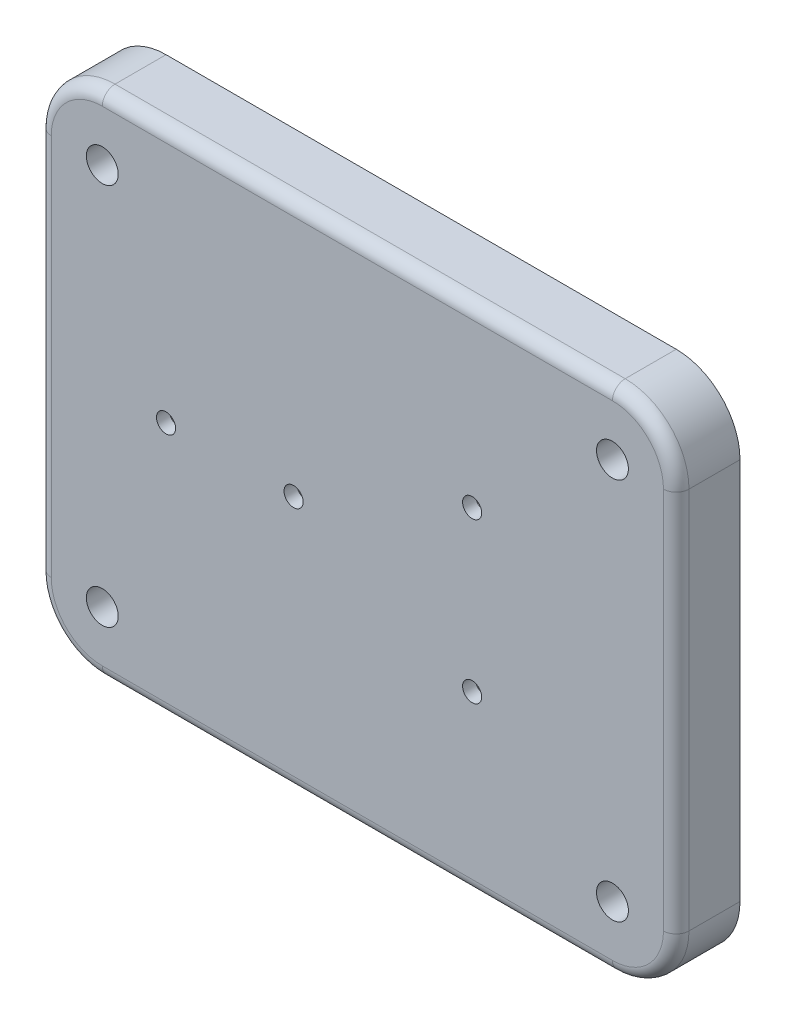
ISO-10303-21;
HEADER;
FILE_DESCRIPTION(('STEP AP214'),'2;1');
FILE_NAME('part.step','',(''),(''),'','','');
FILE_SCHEMA(('AUTOMOTIVE_DESIGN { 1 0 10303 214 1 1 1 1 }'));
ENDSEC;
DATA;
#1=APPLICATION_CONTEXT('core data for automotive mechanical design processes');
#2=APPLICATION_PROTOCOL_DEFINITION('international standard','automotive_design',2000,#1);
#3=PRODUCT_CONTEXT('',#1,'mechanical');
#4=PRODUCT('Part','Part','',(#3));
#5=PRODUCT_RELATED_PRODUCT_CATEGORY('part','',(#4));
#6=PRODUCT_DEFINITION_FORMATION('','',#4);
#7=PRODUCT_DEFINITION_CONTEXT('part definition',#1,'design');
#8=PRODUCT_DEFINITION('design','',#6,#7);
#9=PRODUCT_DEFINITION_SHAPE('','',#8);
#10=(LENGTH_UNIT() NAMED_UNIT(*) SI_UNIT(.MILLI.,.METRE.));
#11=(NAMED_UNIT(*) PLANE_ANGLE_UNIT() SI_UNIT($,.RADIAN.));
#12=(NAMED_UNIT(*) SI_UNIT($,.STERADIAN.) SOLID_ANGLE_UNIT());
#13=UNCERTAINTY_MEASURE_WITH_UNIT(LENGTH_MEASURE(1.E-05),#10,'distance_accuracy_value','');
#14=(GEOMETRIC_REPRESENTATION_CONTEXT(3) GLOBAL_UNCERTAINTY_ASSIGNED_CONTEXT((#13)) GLOBAL_UNIT_ASSIGNED_CONTEXT((#10,
#11,#12)) REPRESENTATION_CONTEXT('',''));
#15=CARTESIAN_POINT('',(0.,0.,0.));
#16=DIRECTION('',(0.,0.,1.));
#17=DIRECTION('',(1.,0.,0.));
#18=AXIS2_PLACEMENT_3D('',#15,#16,#17);
#19=CARTESIAN_POINT('',(0.,0.,0.));
#20=DIRECTION('',(0.,0.,1.));
#21=DIRECTION('',(1.,0.,0.));
#22=AXIS2_PLACEMENT_3D('',#19,#20,#21);
#23=PLANE('',#22);
#24=CARTESIAN_POINT('',(40.,30.,0.));
#25=DIRECTION('',(0.,0.,1.));
#26=DIRECTION('',(1.,0.,0.));
#27=AXIS2_PLACEMENT_3D('',#24,#25,#26);
#28=CIRCLE('',#27,4.5);
#29=CARTESIAN_POINT('',(44.5,30.,0.));
#30=VERTEX_POINT('',#29);
#31=EDGE_CURVE('E235',#30,#30,#28,.T.);
#32=ORIENTED_EDGE('',*,*,#31,.F.);
#33=EDGE_LOOP('',(#32));
#34=FACE_BOUND('',#33,.T.);
#35=CARTESIAN_POINT('',(40.,30.,0.));
#36=DIRECTION('',(0.,0.,1.));
#37=DIRECTION('',(1.,0.,0.));
#38=AXIS2_PLACEMENT_3D('',#35,#36,#37);
#39=CIRCLE('',#38,2.5);
#40=CARTESIAN_POINT('',(42.5,30.,0.));
#41=VERTEX_POINT('',#40);
#42=EDGE_CURVE('E322',#41,#41,#39,.T.);
#43=ORIENTED_EDGE('',*,*,#42,.T.);
#44=EDGE_LOOP('',(#43));
#45=FACE_BOUND('',#44,.T.);
#46=ADVANCED_FACE('F39',(#34,#45),#23,.F.);
#47=CARTESIAN_POINT('',(40.,-30.,0.));
#48=DIRECTION('',(0.,0.,1.));
#49=DIRECTION('',(1.,0.,0.));
#50=AXIS2_PLACEMENT_3D('',#47,#48,#49);
#51=CIRCLE('',#50,4.5);
#52=CARTESIAN_POINT('',(44.5,-30.,0.));
#53=VERTEX_POINT('',#52);
#54=EDGE_CURVE('E240',#53,#53,#51,.T.);
#55=ORIENTED_EDGE('',*,*,#54,.F.);
#56=EDGE_LOOP('',(#55));
#57=FACE_BOUND('',#56,.T.);
#58=CARTESIAN_POINT('',(40.,-30.,0.));
#59=DIRECTION('',(0.,0.,1.));
#60=DIRECTION('',(1.,0.,0.));
#61=AXIS2_PLACEMENT_3D('',#58,#59,#60);
#62=CIRCLE('',#61,2.5);
#63=CARTESIAN_POINT('',(42.5,-30.,0.));
#64=VERTEX_POINT('',#63);
#65=EDGE_CURVE('E314',#64,#64,#62,.T.);
#66=ORIENTED_EDGE('',*,*,#65,.T.);
#67=EDGE_LOOP('',(#66));
#68=FACE_BOUND('',#67,.T.);
#69=ADVANCED_FACE('F498',(#57,#68),#23,.F.);
#70=CARTESIAN_POINT('',(-40.,-30.,0.));
#71=DIRECTION('',(0.,0.,1.));
#72=DIRECTION('',(1.,0.,0.));
#73=AXIS2_PLACEMENT_3D('',#70,#71,#72);
#74=CIRCLE('',#73,4.5);
#75=CARTESIAN_POINT('',(-35.5,-30.,0.));
#76=VERTEX_POINT('',#75);
#77=EDGE_CURVE('E245',#76,#76,#74,.T.);
#78=ORIENTED_EDGE('',*,*,#77,.F.);
#79=EDGE_LOOP('',(#78));
#80=FACE_BOUND('',#79,.T.);
#81=CARTESIAN_POINT('',(-40.,-30.,0.));
#82=DIRECTION('',(0.,0.,1.));
#83=DIRECTION('',(1.,0.,0.));
#84=AXIS2_PLACEMENT_3D('',#81,#82,#83);
#85=CIRCLE('',#84,2.5);
#86=CARTESIAN_POINT('',(-37.5,-30.,0.));
#87=VERTEX_POINT('',#86);
#88=EDGE_CURVE('E305',#87,#87,#85,.T.);
#89=ORIENTED_EDGE('',*,*,#88,.T.);
#90=EDGE_LOOP('',(#89));
#91=FACE_BOUND('',#90,.T.);
#92=ADVANCED_FACE('F505',(#80,#91),#23,.F.);
#93=DIRECTION('',(1.,0.,0.));
#94=VECTOR('',#93,1.);
#95=CARTESIAN_POINT('',(-50.,-40.,0.));
#96=LINE('',#95,#94);
#97=CARTESIAN_POINT('',(-40.,-40.,0.));
#98=VERTEX_POINT('',#97);
#99=CARTESIAN_POINT('',(40.,-40.,0.));
#100=VERTEX_POINT('',#99);
#101=EDGE_CURVE('E350',#98,#100,#96,.T.);
#102=ORIENTED_EDGE('',*,*,#101,.F.);
#103=CARTESIAN_POINT('',(-40.,-30.,0.));
#104=DIRECTION('',(0.,0.,1.));
#105=DIRECTION('',(1.,0.,0.));
#106=AXIS2_PLACEMENT_3D('',#103,#104,#105);
#107=CIRCLE('',#106,10.);
#108=CARTESIAN_POINT('',(-50.,-30.,0.));
#109=VERTEX_POINT('',#108);
#110=EDGE_CURVE('E370',#98,#109,#107,.F.);
#111=ORIENTED_EDGE('',*,*,#110,.T.);
#112=DIRECTION('',(0.,-1.,0.));
#113=VECTOR('',#112,1.);
#114=CARTESIAN_POINT('',(-50.,40.,0.));
#115=LINE('',#114,#113);
#116=CARTESIAN_POINT('',(-50.,30.,0.));
#117=VERTEX_POINT('',#116);
#118=EDGE_CURVE('E346',#117,#109,#115,.T.);
#119=ORIENTED_EDGE('',*,*,#118,.F.);
#120=CARTESIAN_POINT('',(-40.,30.,0.));
#121=DIRECTION('',(0.,0.,1.));
#122=DIRECTION('',(1.,0.,0.));
#123=AXIS2_PLACEMENT_3D('',#120,#121,#122);
#124=CIRCLE('',#123,10.);
#125=CARTESIAN_POINT('',(-40.,40.,0.));
#126=VERTEX_POINT('',#125);
#127=EDGE_CURVE('E361',#117,#126,#124,.F.);
#128=ORIENTED_EDGE('',*,*,#127,.T.);
#129=DIRECTION('',(-1.,0.,0.));
#130=VECTOR('',#129,1.);
#131=CARTESIAN_POINT('',(-50.,40.,0.));
#132=LINE('',#131,#130);
#133=CARTESIAN_POINT('',(40.,40.,0.));
#134=VERTEX_POINT('',#133);
#135=EDGE_CURVE('E342',#134,#126,#132,.T.);
#136=ORIENTED_EDGE('',*,*,#135,.F.);
#137=CARTESIAN_POINT('',(40.,30.,0.));
#138=DIRECTION('',(0.,0.,1.));
#139=DIRECTION('',(1.,0.,0.));
#140=AXIS2_PLACEMENT_3D('',#137,#138,#139);
#141=CIRCLE('',#140,10.);
#142=CARTESIAN_POINT('',(50.,30.,0.));
#143=VERTEX_POINT('',#142);
#144=EDGE_CURVE('E364',#134,#143,#141,.F.);
#145=ORIENTED_EDGE('',*,*,#144,.T.);
#146=DIRECTION('',(0.,1.,0.));
#147=VECTOR('',#146,1.);
#148=CARTESIAN_POINT('',(50.,40.,0.));
#149=LINE('',#148,#147);
#150=CARTESIAN_POINT('',(50.,-30.,0.));
#151=VERTEX_POINT('',#150);
#152=EDGE_CURVE('E335',#151,#143,#149,.T.);
#153=ORIENTED_EDGE('',*,*,#152,.F.);
#154=CARTESIAN_POINT('',(40.,-30.,0.));
#155=DIRECTION('',(0.,0.,1.));
#156=DIRECTION('',(1.,0.,0.));
#157=AXIS2_PLACEMENT_3D('',#154,#155,#156);
#158=CIRCLE('',#157,10.);
#159=EDGE_CURVE('E367',#151,#100,#158,.F.);
#160=ORIENTED_EDGE('',*,*,#159,.T.);
#161=EDGE_LOOP('',(#102,#111,#119,#128,#136,#145,#153,#160));
#162=FACE_BOUND('',#161,.T.);
#163=CARTESIAN_POINT('',(-40.,-30.,0.));
#164=DIRECTION('',(0.,0.,1.));
#165=DIRECTION('',(1.,0.,0.));
#166=AXIS2_PLACEMENT_3D('',#163,#164,#165);
#167=CIRCLE('',#166,8.);
#168=CARTESIAN_POINT('',(-40.,-38.,0.));
#169=VERTEX_POINT('',#168);
#170=CARTESIAN_POINT('',(-48.,-30.,0.));
#171=VERTEX_POINT('',#170);
#172=EDGE_CURVE('E259',#169,#171,#167,.F.);
#173=ORIENTED_EDGE('',*,*,#172,.F.);
#174=DIRECTION('',(1.,0.,0.));
#175=VECTOR('',#174,1.);
#176=CARTESIAN_POINT('',(-50.,-38.,0.));
#177=LINE('',#176,#175);
#178=CARTESIAN_POINT('',(40.,-38.,0.));
#179=VERTEX_POINT('',#178);
#180=EDGE_CURVE('E270',#169,#179,#177,.T.);
#181=ORIENTED_EDGE('',*,*,#180,.T.);
#182=CARTESIAN_POINT('',(40.,-30.,0.));
#183=DIRECTION('',(0.,0.,1.));
#184=DIRECTION('',(1.,0.,0.));
#185=AXIS2_PLACEMENT_3D('',#182,#183,#184);
#186=CIRCLE('',#185,8.);
#187=CARTESIAN_POINT('',(48.,-30.,0.));
#188=VERTEX_POINT('',#187);
#189=EDGE_CURVE('E274',#188,#179,#186,.F.);
#190=ORIENTED_EDGE('',*,*,#189,.F.);
#191=DIRECTION('',(0.,1.,0.));
#192=VECTOR('',#191,1.);
#193=CARTESIAN_POINT('',(48.,40.,0.));
#194=LINE('',#193,#192);
#195=CARTESIAN_POINT('',(48.,30.,0.));
#196=VERTEX_POINT('',#195);
#197=EDGE_CURVE('E57',#188,#196,#194,.T.);
#198=ORIENTED_EDGE('',*,*,#197,.T.);
#199=CARTESIAN_POINT('',(40.,30.,0.));
#200=DIRECTION('',(0.,0.,1.));
#201=DIRECTION('',(1.,0.,0.));
#202=AXIS2_PLACEMENT_3D('',#199,#200,#201);
#203=CIRCLE('',#202,8.);
#204=CARTESIAN_POINT('',(40.,38.,0.));
#205=VERTEX_POINT('',#204);
#206=EDGE_CURVE('E184',#205,#196,#203,.F.);
#207=ORIENTED_EDGE('',*,*,#206,.F.);
#208=DIRECTION('',(-1.,0.,0.));
#209=VECTOR('',#208,1.);
#210=CARTESIAN_POINT('',(-50.,38.,0.));
#211=LINE('',#210,#209);
#212=CARTESIAN_POINT('',(-40.,38.,0.));
#213=VERTEX_POINT('',#212);
#214=EDGE_CURVE('E273',#205,#213,#211,.T.);
#215=ORIENTED_EDGE('',*,*,#214,.T.);
#216=CARTESIAN_POINT('',(-40.,30.,0.));
#217=DIRECTION('',(0.,0.,1.));
#218=DIRECTION('',(1.,0.,0.));
#219=AXIS2_PLACEMENT_3D('',#216,#217,#218);
#220=CIRCLE('',#219,8.);
#221=CARTESIAN_POINT('',(-48.,30.,0.));
#222=VERTEX_POINT('',#221);
#223=EDGE_CURVE('E266',#222,#213,#220,.F.);
#224=ORIENTED_EDGE('',*,*,#223,.F.);
#225=DIRECTION('',(0.,-1.,0.));
#226=VECTOR('',#225,1.);
#227=CARTESIAN_POINT('',(-48.,40.,0.));
#228=LINE('',#227,#226);
#229=EDGE_CURVE('E280',#222,#171,#228,.T.);
#230=ORIENTED_EDGE('',*,*,#229,.T.);
#231=EDGE_LOOP('',(#173,#181,#190,#198,#207,#215,#224,#230));
#232=FACE_BOUND('',#231,.T.);
#233=ADVANCED_FACE('F515',(#162,#232),#23,.F.);
#234=CARTESIAN_POINT('',(50.,40.,10.));
#235=DIRECTION('',(-1.,0.,0.));
#236=DIRECTION('',(0.,-1.,0.));
#237=AXIS2_PLACEMENT_3D('',#234,#235,#236);
#238=PLANE('',#237);
#239=DIRECTION('',(0.,0.,-1.));
#240=VECTOR('',#239,1.);
#241=CARTESIAN_POINT('',(50.,30.,10.));
#242=LINE('',#241,#240);
#243=CARTESIAN_POINT('',(50.,30.,8.));
#244=VERTEX_POINT('',#243);
#245=EDGE_CURVE('E380',#143,#244,#242,.F.);
#246=ORIENTED_EDGE('',*,*,#245,.T.);
#247=DIRECTION('',(0.,1.,0.));
#248=VECTOR('',#247,1.);
#249=CARTESIAN_POINT('',(50.,-30.,8.));
#250=LINE('',#249,#248);
#251=CARTESIAN_POINT('',(50.,-30.,8.));
#252=VERTEX_POINT('',#251);
#253=EDGE_CURVE('E422',#244,#252,#250,.F.);
#254=ORIENTED_EDGE('',*,*,#253,.T.);
#255=DIRECTION('',(0.,0.,-1.));
#256=VECTOR('',#255,1.);
#257=CARTESIAN_POINT('',(50.,-30.,10.));
#258=LINE('',#257,#256);
#259=EDGE_CURVE('E384',#252,#151,#258,.T.);
#260=ORIENTED_EDGE('',*,*,#259,.T.);
#261=ORIENTED_EDGE('',*,*,#152,.T.);
#262=EDGE_LOOP('',(#246,#254,#260,#261));
#263=FACE_BOUND('',#262,.T.);
#264=ADVANCED_FACE('F528',(#263),#238,.F.);
#265=CARTESIAN_POINT('',(-50.,40.,10.));
#266=DIRECTION('',(0.,-1.,0.));
#267=DIRECTION('',(0.,0.,-1.));
#268=AXIS2_PLACEMENT_3D('',#265,#266,#267);
#269=PLANE('',#268);
#270=DIRECTION('',(0.,0.,-1.));
#271=VECTOR('',#270,1.);
#272=CARTESIAN_POINT('',(-40.,40.,10.));
#273=LINE('',#272,#271);
#274=CARTESIAN_POINT('',(-40.,40.,8.));
#275=VERTEX_POINT('',#274);
#276=EDGE_CURVE('E387',#126,#275,#273,.F.);
#277=ORIENTED_EDGE('',*,*,#276,.T.);
#278=DIRECTION('',(-1.,0.,0.));
#279=VECTOR('',#278,1.);
#280=CARTESIAN_POINT('',(40.,40.,8.));
#281=LINE('',#280,#279);
#282=CARTESIAN_POINT('',(40.,40.,8.));
#283=VERTEX_POINT('',#282);
#284=EDGE_CURVE('E11',#275,#283,#281,.F.);
#285=ORIENTED_EDGE('',*,*,#284,.T.);
#286=DIRECTION('',(0.,0.,-1.));
#287=VECTOR('',#286,1.);
#288=CARTESIAN_POINT('',(40.,40.,10.));
#289=LINE('',#288,#287);
#290=EDGE_CURVE('E390',#283,#134,#289,.T.);
#291=ORIENTED_EDGE('',*,*,#290,.T.);
#292=ORIENTED_EDGE('',*,*,#135,.T.);
#293=EDGE_LOOP('',(#277,#285,#291,#292));
#294=FACE_BOUND('',#293,.T.);
#295=ADVANCED_FACE('F534',(#294),#269,.F.);
#296=CARTESIAN_POINT('',(-50.,40.,10.));
#297=DIRECTION('',(1.,0.,0.));
#298=DIRECTION('',(0.,0.,-1.));
#299=AXIS2_PLACEMENT_3D('',#296,#297,#298);
#300=PLANE('',#299);
#301=DIRECTION('',(0.,0.,-1.));
#302=VECTOR('',#301,1.);
#303=CARTESIAN_POINT('',(-50.,-30.,10.));
#304=LINE('',#303,#302);
#305=CARTESIAN_POINT('',(-50.,-30.,8.));
#306=VERTEX_POINT('',#305);
#307=EDGE_CURVE('E376',#109,#306,#304,.F.);
#308=ORIENTED_EDGE('',*,*,#307,.T.);
#309=DIRECTION('',(0.,-1.,0.));
#310=VECTOR('',#309,1.);
#311=CARTESIAN_POINT('',(-50.,30.,8.));
#312=LINE('',#311,#310);
#313=CARTESIAN_POINT('',(-50.,30.,8.));
#314=VERTEX_POINT('',#313);
#315=EDGE_CURVE('E434',#306,#314,#312,.F.);
#316=ORIENTED_EDGE('',*,*,#315,.T.);
#317=DIRECTION('',(0.,0.,-1.));
#318=VECTOR('',#317,1.);
#319=CARTESIAN_POINT('',(-50.,30.,10.));
#320=LINE('',#319,#318);
#321=EDGE_CURVE('E373',#314,#117,#320,.T.);
#322=ORIENTED_EDGE('',*,*,#321,.T.);
#323=ORIENTED_EDGE('',*,*,#118,.T.);
#324=EDGE_LOOP('',(#308,#316,#322,#323));
#325=FACE_BOUND('',#324,.T.);
#326=ADVANCED_FACE('F664',(#325),#300,.F.);
#327=CARTESIAN_POINT('',(-50.,-40.,10.));
#328=DIRECTION('',(0.,1.,0.));
#329=DIRECTION('',(0.,0.,1.));
#330=AXIS2_PLACEMENT_3D('',#327,#328,#329);
#331=PLANE('',#330);
#332=DIRECTION('',(0.,0.,-1.));
#333=VECTOR('',#332,1.);
#334=CARTESIAN_POINT('',(40.,-40.,10.));
#335=LINE('',#334,#333);
#336=CARTESIAN_POINT('',(40.,-40.,8.));
#337=VERTEX_POINT('',#336);
#338=EDGE_CURVE('E354',#100,#337,#335,.F.);
#339=ORIENTED_EDGE('',*,*,#338,.T.);
#340=DIRECTION('',(1.,0.,0.));
#341=VECTOR('',#340,1.);
#342=CARTESIAN_POINT('',(-40.,-40.,8.));
#343=LINE('',#342,#341);
#344=CARTESIAN_POINT('',(-40.,-40.,8.));
#345=VERTEX_POINT('',#344);
#346=EDGE_CURVE('E428',#337,#345,#343,.F.);
#347=ORIENTED_EDGE('',*,*,#346,.T.);
#348=DIRECTION('',(0.,0.,-1.));
#349=VECTOR('',#348,1.);
#350=CARTESIAN_POINT('',(-40.,-40.,10.));
#351=LINE('',#350,#349);
#352=EDGE_CURVE('E358',#345,#98,#351,.T.);
#353=ORIENTED_EDGE('',*,*,#352,.T.);
#354=ORIENTED_EDGE('',*,*,#101,.T.);
#355=EDGE_LOOP('',(#339,#347,#353,#354));
#356=FACE_BOUND('',#355,.T.);
#357=ADVANCED_FACE('F523',(#356),#331,.F.);
#358=CARTESIAN_POINT('',(0.,0.,10.));
#359=DIRECTION('',(0.,0.,1.));
#360=DIRECTION('',(1.,0.,0.));
#361=AXIS2_PLACEMENT_3D('',#358,#359,#360);
#362=PLANE('',#361);
#363=CARTESIAN_POINT('',(-30.,0.,10.));
#364=DIRECTION('',(0.,0.,1.));
#365=DIRECTION('',(1.,0.,0.));
#366=AXIS2_PLACEMENT_3D('',#363,#364,#365);
#367=CIRCLE('',#366,1.5);
#368=CARTESIAN_POINT('',(-28.5,0.,10.));
#369=VERTEX_POINT('',#368);
#370=EDGE_CURVE('E472',#369,#369,#367,.T.);
#371=ORIENTED_EDGE('',*,*,#370,.F.);
#372=EDGE_LOOP('',(#371));
#373=FACE_BOUND('',#372,.T.);
#374=CARTESIAN_POINT('',(-10.,0.,10.));
#375=DIRECTION('',(0.,0.,1.));
#376=DIRECTION('',(1.,0.,0.));
#377=AXIS2_PLACEMENT_3D('',#374,#375,#376);
#378=CIRCLE('',#377,1.5);
#379=CARTESIAN_POINT('',(-8.5,0.,10.));
#380=VERTEX_POINT('',#379);
#381=EDGE_CURVE('E915',#380,#380,#378,.T.);
#382=ORIENTED_EDGE('',*,*,#381,.F.);
#383=EDGE_LOOP('',(#382));
#384=FACE_BOUND('',#383,.T.);
#385=CARTESIAN_POINT('',(18.,12.5,10.));
#386=DIRECTION('',(0.,0.,1.));
#387=DIRECTION('',(1.,0.,0.));
#388=AXIS2_PLACEMENT_3D('',#385,#386,#387);
#389=CIRCLE('',#388,1.5);
#390=CARTESIAN_POINT('',(19.5,12.5,10.));
#391=VERTEX_POINT('',#390);
#392=EDGE_CURVE('E907',#391,#391,#389,.T.);
#393=ORIENTED_EDGE('',*,*,#392,.F.);
#394=EDGE_LOOP('',(#393));
#395=FACE_BOUND('',#394,.T.);
#396=CARTESIAN_POINT('',(18.,-12.5,10.));
#397=DIRECTION('',(0.,0.,1.));
#398=DIRECTION('',(1.,0.,0.));
#399=AXIS2_PLACEMENT_3D('',#396,#397,#398);
#400=CIRCLE('',#399,1.5);
#401=CARTESIAN_POINT('',(19.5,-12.5,10.));
#402=VERTEX_POINT('',#401);
#403=EDGE_CURVE('E916',#402,#402,#400,.T.);
#404=ORIENTED_EDGE('',*,*,#403,.F.);
#405=EDGE_LOOP('',(#404));
#406=FACE_BOUND('',#405,.T.);
#407=DIRECTION('',(0.,1.,0.));
#408=VECTOR('',#407,1.);
#409=CARTESIAN_POINT('',(48.,30.,10.));
#410=LINE('',#409,#408);
#411=CARTESIAN_POINT('',(48.,-30.,10.));
#412=VERTEX_POINT('',#411);
#413=CARTESIAN_POINT('',(48.,30.,10.));
#414=VERTEX_POINT('',#413);
#415=EDGE_CURVE('E411',#412,#414,#410,.T.);
#416=ORIENTED_EDGE('',*,*,#415,.T.);
#417=CARTESIAN_POINT('',(40.,30.,10.));
#418=DIRECTION('',(0.,0.,1.));
#419=DIRECTION('',(1.,0.,0.));
#420=AXIS2_PLACEMENT_3D('',#417,#418,#419);
#421=CIRCLE('',#420,8.);
#422=CARTESIAN_POINT('',(40.,38.,10.));
#423=VERTEX_POINT('',#422);
#424=EDGE_CURVE('E414',#414,#423,#421,.T.);
#425=ORIENTED_EDGE('',*,*,#424,.T.);
#426=DIRECTION('',(-1.,0.,0.));
#427=VECTOR('',#426,1.);
#428=CARTESIAN_POINT('',(-40.,38.,10.));
#429=LINE('',#428,#427);
#430=CARTESIAN_POINT('',(-40.,38.,10.));
#431=VERTEX_POINT('',#430);
#432=EDGE_CURVE('E393',#423,#431,#429,.T.);
#433=ORIENTED_EDGE('',*,*,#432,.T.);
#434=CARTESIAN_POINT('',(-40.,30.,10.));
#435=DIRECTION('',(0.,0.,1.));
#436=DIRECTION('',(1.,0.,0.));
#437=AXIS2_PLACEMENT_3D('',#434,#435,#436);
#438=CIRCLE('',#437,8.);
#439=CARTESIAN_POINT('',(-48.,30.,10.));
#440=VERTEX_POINT('',#439);
#441=EDGE_CURVE('E396',#431,#440,#438,.T.);
#442=ORIENTED_EDGE('',*,*,#441,.T.);
#443=DIRECTION('',(0.,-1.,0.));
#444=VECTOR('',#443,1.);
#445=CARTESIAN_POINT('',(-48.,-30.,10.));
#446=LINE('',#445,#444);
#447=CARTESIAN_POINT('',(-48.,-30.,10.));
#448=VERTEX_POINT('',#447);
#449=EDGE_CURVE('E399',#440,#448,#446,.T.);
#450=ORIENTED_EDGE('',*,*,#449,.T.);
#451=CARTESIAN_POINT('',(-40.,-30.,10.));
#452=DIRECTION('',(0.,0.,1.));
#453=DIRECTION('',(1.,0.,0.));
#454=AXIS2_PLACEMENT_3D('',#451,#452,#453);
#455=CIRCLE('',#454,8.);
#456=CARTESIAN_POINT('',(-40.,-38.,10.));
#457=VERTEX_POINT('',#456);
#458=EDGE_CURVE('E402',#448,#457,#455,.T.);
#459=ORIENTED_EDGE('',*,*,#458,.T.);
#460=DIRECTION('',(1.,0.,0.));
#461=VECTOR('',#460,1.);
#462=CARTESIAN_POINT('',(40.,-38.,10.));
#463=LINE('',#462,#461);
#464=CARTESIAN_POINT('',(40.,-38.,10.));
#465=VERTEX_POINT('',#464);
#466=EDGE_CURVE('E405',#457,#465,#463,.T.);
#467=ORIENTED_EDGE('',*,*,#466,.T.);
#468=CARTESIAN_POINT('',(40.,-30.,10.));
#469=DIRECTION('',(0.,0.,1.));
#470=DIRECTION('',(1.,0.,0.));
#471=AXIS2_PLACEMENT_3D('',#468,#469,#470);
#472=CIRCLE('',#471,8.);
#473=EDGE_CURVE('E408',#465,#412,#472,.T.);
#474=ORIENTED_EDGE('',*,*,#473,.T.);
#475=EDGE_LOOP('',(#416,#425,#433,#442,#450,#459,#467,#474));
#476=FACE_BOUND('',#475,.T.);
#477=CARTESIAN_POINT('',(40.,30.,10.));
#478=DIRECTION('',(0.,0.,1.));
#479=DIRECTION('',(1.,0.,0.));
#480=AXIS2_PLACEMENT_3D('',#477,#478,#479);
#481=CIRCLE('',#480,2.5);
#482=CARTESIAN_POINT('',(42.5,30.,10.));
#483=VERTEX_POINT('',#482);
#484=EDGE_CURVE('E326',#483,#483,#481,.T.);
#485=ORIENTED_EDGE('',*,*,#484,.F.);
#486=EDGE_LOOP('',(#485));
#487=FACE_BOUND('',#486,.T.);
#488=CARTESIAN_POINT('',(40.,-30.,10.));
#489=DIRECTION('',(0.,0.,1.));
#490=DIRECTION('',(1.,0.,0.));
#491=AXIS2_PLACEMENT_3D('',#488,#489,#490);
#492=CIRCLE('',#491,2.5);
#493=CARTESIAN_POINT('',(42.5,-30.,10.));
#494=VERTEX_POINT('',#493);
#495=EDGE_CURVE('E318',#494,#494,#492,.T.);
#496=ORIENTED_EDGE('',*,*,#495,.F.);
#497=EDGE_LOOP('',(#496));
#498=FACE_BOUND('',#497,.T.);
#499=CARTESIAN_POINT('',(-40.,-30.,10.));
#500=DIRECTION('',(0.,0.,1.));
#501=DIRECTION('',(1.,0.,0.));
#502=AXIS2_PLACEMENT_3D('',#499,#500,#501);
#503=CIRCLE('',#502,2.5);
#504=CARTESIAN_POINT('',(-37.5,-30.,10.));
#505=VERTEX_POINT('',#504);
#506=EDGE_CURVE('E310',#505,#505,#503,.T.);
#507=ORIENTED_EDGE('',*,*,#506,.F.);
#508=EDGE_LOOP('',(#507));
#509=FACE_BOUND('',#508,.T.);
#510=CARTESIAN_POINT('',(-40.,30.,10.));
#511=DIRECTION('',(0.,0.,1.));
#512=DIRECTION('',(1.,0.,0.));
#513=AXIS2_PLACEMENT_3D('',#510,#511,#512);
#514=CIRCLE('',#513,2.5);
#515=CARTESIAN_POINT('',(-37.5,30.,10.));
#516=VERTEX_POINT('',#515);
#517=EDGE_CURVE('E309',#516,#516,#514,.T.);
#518=ORIENTED_EDGE('',*,*,#517,.F.);
#519=EDGE_LOOP('',(#518));
#520=FACE_BOUND('',#519,.T.);
#521=ADVANCED_FACE('F513',(#373,#384,#395,#406,#476,#487,#498,#509,#520),#362,.T.);
#522=CARTESIAN_POINT('',(-40.,30.,0.));
#523=DIRECTION('',(0.,0.,1.));
#524=DIRECTION('',(1.,0.,0.));
#525=AXIS2_PLACEMENT_3D('',#522,#523,#524);
#526=CIRCLE('',#525,4.5);
#527=CARTESIAN_POINT('',(-35.5,30.,0.));
#528=VERTEX_POINT('',#527);
#529=EDGE_CURVE('E250',#528,#528,#526,.T.);
#530=ORIENTED_EDGE('',*,*,#529,.F.);
#531=EDGE_LOOP('',(#530));
#532=FACE_BOUND('',#531,.T.);
#533=CARTESIAN_POINT('',(-40.,30.,0.));
#534=DIRECTION('',(0.,0.,1.));
#535=DIRECTION('',(1.,0.,0.));
#536=AXIS2_PLACEMENT_3D('',#533,#534,#535);
#537=CIRCLE('',#536,2.5);
#538=CARTESIAN_POINT('',(-37.5,30.,0.));
#539=VERTEX_POINT('',#538);
#540=EDGE_CURVE('E331',#539,#539,#537,.T.);
#541=ORIENTED_EDGE('',*,*,#540,.T.);
#542=EDGE_LOOP('',(#541));
#543=FACE_BOUND('',#542,.T.);
#544=ADVANCED_FACE('F501',(#532,#543),#23,.F.);
#545=CARTESIAN_POINT('',(-40.,-30.,10.));
#546=DIRECTION('',(0.,0.,-1.));
#547=DIRECTION('',(-1.,0.,0.));
#548=AXIS2_PLACEMENT_3D('',#545,#546,#547);
#549=CYLINDRICAL_SURFACE('',#548,10.);
#550=ORIENTED_EDGE('',*,*,#352,.F.);
#551=CARTESIAN_POINT('',(-40.,-30.,8.));
#552=DIRECTION('',(0.,0.,1.));
#553=DIRECTION('',(1.,0.,0.));
#554=AXIS2_PLACEMENT_3D('',#551,#552,#553);
#555=CIRCLE('',#554,10.);
#556=EDGE_CURVE('E431',#345,#306,#555,.F.);
#557=ORIENTED_EDGE('',*,*,#556,.T.);
#558=ORIENTED_EDGE('',*,*,#307,.F.);
#559=ORIENTED_EDGE('',*,*,#110,.F.);
#560=EDGE_LOOP('',(#550,#557,#558,#559));
#561=FACE_BOUND('',#560,.T.);
#562=ADVANCED_FACE('F512',(#561),#549,.T.);
#563=CARTESIAN_POINT('',(40.,-30.,10.));
#564=DIRECTION('',(0.,0.,-1.));
#565=DIRECTION('',(-1.,0.,0.));
#566=AXIS2_PLACEMENT_3D('',#563,#564,#565);
#567=CYLINDRICAL_SURFACE('',#566,10.);
#568=ORIENTED_EDGE('',*,*,#259,.F.);
#569=CARTESIAN_POINT('',(40.,-30.,8.));
#570=DIRECTION('',(0.,0.,1.));
#571=DIRECTION('',(1.,0.,0.));
#572=AXIS2_PLACEMENT_3D('',#569,#570,#571);
#573=CIRCLE('',#572,10.);
#574=EDGE_CURVE('E425',#252,#337,#573,.F.);
#575=ORIENTED_EDGE('',*,*,#574,.T.);
#576=ORIENTED_EDGE('',*,*,#338,.F.);
#577=ORIENTED_EDGE('',*,*,#159,.F.);
#578=EDGE_LOOP('',(#568,#575,#576,#577));
#579=FACE_BOUND('',#578,.T.);
#580=ADVANCED_FACE('F520',(#579),#567,.T.);
#581=CARTESIAN_POINT('',(40.,30.,10.));
#582=DIRECTION('',(0.,0.,-1.));
#583=DIRECTION('',(-1.,0.,0.));
#584=AXIS2_PLACEMENT_3D('',#581,#582,#583);
#585=CYLINDRICAL_SURFACE('',#584,10.);
#586=ORIENTED_EDGE('',*,*,#290,.F.);
#587=CARTESIAN_POINT('',(40.,30.,8.));
#588=DIRECTION('',(0.,0.,1.));
#589=DIRECTION('',(1.,0.,0.));
#590=AXIS2_PLACEMENT_3D('',#587,#588,#589);
#591=CIRCLE('',#590,10.);
#592=EDGE_CURVE('E418',#283,#244,#591,.F.);
#593=ORIENTED_EDGE('',*,*,#592,.T.);
#594=ORIENTED_EDGE('',*,*,#245,.F.);
#595=ORIENTED_EDGE('',*,*,#144,.F.);
#596=EDGE_LOOP('',(#586,#593,#594,#595));
#597=FACE_BOUND('',#596,.T.);
#598=ADVANCED_FACE('F609',(#597),#585,.T.);
#599=CARTESIAN_POINT('',(-40.,30.,10.));
#600=DIRECTION('',(0.,0.,-1.));
#601=DIRECTION('',(-1.,0.,0.));
#602=AXIS2_PLACEMENT_3D('',#599,#600,#601);
#603=CYLINDRICAL_SURFACE('',#602,10.);
#604=ORIENTED_EDGE('',*,*,#321,.F.);
#605=CARTESIAN_POINT('',(-40.,30.,8.));
#606=DIRECTION('',(0.,0.,1.));
#607=DIRECTION('',(1.,0.,0.));
#608=AXIS2_PLACEMENT_3D('',#605,#606,#607);
#609=CIRCLE('',#608,10.);
#610=EDGE_CURVE('E49',#314,#275,#609,.F.);
#611=ORIENTED_EDGE('',*,*,#610,.T.);
#612=ORIENTED_EDGE('',*,*,#276,.F.);
#613=ORIENTED_EDGE('',*,*,#127,.F.);
#614=EDGE_LOOP('',(#604,#611,#612,#613));
#615=FACE_BOUND('',#614,.T.);
#616=ADVANCED_FACE('F604',(#615),#603,.T.);
#617=CARTESIAN_POINT('',(-40.,30.,0.));
#618=DIRECTION('',(0.,0.,1.));
#619=DIRECTION('',(1.,0.,0.));
#620=AXIS2_PLACEMENT_3D('',#617,#618,#619);
#621=CYLINDRICAL_SURFACE('',#620,2.5);
#622=ORIENTED_EDGE('',*,*,#540,.F.);
#623=EDGE_LOOP('',(#622));
#624=FACE_BOUND('',#623,.T.);
#625=ORIENTED_EDGE('',*,*,#517,.T.);
#626=EDGE_LOOP('',(#625));
#627=FACE_BOUND('',#626,.T.);
#628=ADVANCED_FACE('F594',(#624,#627),#621,.F.);
#629=CARTESIAN_POINT('',(-40.,-30.,0.));
#630=DIRECTION('',(0.,0.,1.));
#631=DIRECTION('',(1.,0.,0.));
#632=AXIS2_PLACEMENT_3D('',#629,#630,#631);
#633=CYLINDRICAL_SURFACE('',#632,2.5);
#634=ORIENTED_EDGE('',*,*,#88,.F.);
#635=EDGE_LOOP('',(#634));
#636=FACE_BOUND('',#635,.T.);
#637=ORIENTED_EDGE('',*,*,#506,.T.);
#638=EDGE_LOOP('',(#637));
#639=FACE_BOUND('',#638,.T.);
#640=ADVANCED_FACE('F590',(#636,#639),#633,.F.);
#641=CARTESIAN_POINT('',(40.,-30.,0.));
#642=DIRECTION('',(0.,0.,1.));
#643=DIRECTION('',(1.,0.,0.));
#644=AXIS2_PLACEMENT_3D('',#641,#642,#643);
#645=CYLINDRICAL_SURFACE('',#644,2.5);
#646=ORIENTED_EDGE('',*,*,#65,.F.);
#647=EDGE_LOOP('',(#646));
#648=FACE_BOUND('',#647,.T.);
#649=ORIENTED_EDGE('',*,*,#495,.T.);
#650=EDGE_LOOP('',(#649));
#651=FACE_BOUND('',#650,.T.);
#652=ADVANCED_FACE('F593',(#648,#651),#645,.F.);
#653=CARTESIAN_POINT('',(40.,30.,0.));
#654=DIRECTION('',(0.,0.,1.));
#655=DIRECTION('',(1.,0.,0.));
#656=AXIS2_PLACEMENT_3D('',#653,#654,#655);
#657=CYLINDRICAL_SURFACE('',#656,2.5);
#658=ORIENTED_EDGE('',*,*,#42,.F.);
#659=EDGE_LOOP('',(#658));
#660=FACE_BOUND('',#659,.T.);
#661=ORIENTED_EDGE('',*,*,#484,.T.);
#662=EDGE_LOOP('',(#661));
#663=FACE_BOUND('',#662,.T.);
#664=ADVANCED_FACE('F598',(#660,#663),#657,.F.);
#665=CARTESIAN_POINT('',(-40.,-30.,8.));
#666=DIRECTION('',(0.,0.,1.));
#667=DIRECTION('',(1.,0.,0.));
#668=AXIS2_PLACEMENT_3D('',#665,#666,#667);
#669=TOROIDAL_SURFACE('',#668,8.,2.);
#670=CARTESIAN_POINT('',(-48.,-30.,8.));
#671=DIRECTION('',(0.,1.,0.));
#672=DIRECTION('',(0.,0.,1.));
#673=AXIS2_PLACEMENT_3D('',#670,#671,#672);
#674=CIRCLE('',#673,2.);
#675=EDGE_CURVE('E460',#306,#448,#674,.T.);
#676=ORIENTED_EDGE('',*,*,#675,.F.);
#677=ORIENTED_EDGE('',*,*,#556,.F.);
#678=CARTESIAN_POINT('',(-40.,-38.,8.));
#679=DIRECTION('',(1.,0.,0.));
#680=DIRECTION('',(0.,0.,-1.));
#681=AXIS2_PLACEMENT_3D('',#678,#679,#680);
#682=CIRCLE('',#681,2.);
#683=EDGE_CURVE('E330',#457,#345,#682,.T.);
#684=ORIENTED_EDGE('',*,*,#683,.F.);
#685=ORIENTED_EDGE('',*,*,#458,.F.);
#686=EDGE_LOOP('',(#676,#677,#684,#685));
#687=FACE_BOUND('',#686,.T.);
#688=ADVANCED_FACE('F41',(#687),#669,.T.);
#689=CARTESIAN_POINT('',(0.,-38.,8.));
#690=DIRECTION('',(-1.,0.,0.));
#691=DIRECTION('',(0.,0.,1.));
#692=AXIS2_PLACEMENT_3D('',#689,#690,#691);
#693=CYLINDRICAL_SURFACE('',#692,2.);
#694=ORIENTED_EDGE('',*,*,#683,.T.);
#695=ORIENTED_EDGE('',*,*,#346,.F.);
#696=CARTESIAN_POINT('',(40.,-38.,8.));
#697=DIRECTION('',(1.,0.,0.));
#698=DIRECTION('',(0.,0.,-1.));
#699=AXIS2_PLACEMENT_3D('',#696,#697,#698);
#700=CIRCLE('',#699,2.);
#701=EDGE_CURVE('E456',#465,#337,#700,.T.);
#702=ORIENTED_EDGE('',*,*,#701,.F.);
#703=ORIENTED_EDGE('',*,*,#466,.F.);
#704=EDGE_LOOP('',(#694,#695,#702,#703));
#705=FACE_BOUND('',#704,.T.);
#706=ADVANCED_FACE('F644',(#705),#693,.T.);
#707=CARTESIAN_POINT('',(-48.,0.,8.));
#708=DIRECTION('',(0.,1.,0.));
#709=DIRECTION('',(0.,0.,1.));
#710=AXIS2_PLACEMENT_3D('',#707,#708,#709);
#711=CYLINDRICAL_SURFACE('',#710,2.);
#712=ORIENTED_EDGE('',*,*,#675,.T.);
#713=ORIENTED_EDGE('',*,*,#449,.F.);
#714=CARTESIAN_POINT('',(-48.,30.,8.));
#715=DIRECTION('',(0.,1.,0.));
#716=DIRECTION('',(0.,0.,1.));
#717=AXIS2_PLACEMENT_3D('',#714,#715,#716);
#718=CIRCLE('',#717,2.);
#719=EDGE_CURVE('E452',#314,#440,#718,.T.);
#720=ORIENTED_EDGE('',*,*,#719,.F.);
#721=ORIENTED_EDGE('',*,*,#315,.F.);
#722=EDGE_LOOP('',(#712,#713,#720,#721));
#723=FACE_BOUND('',#722,.T.);
#724=ADVANCED_FACE('F641',(#723),#711,.T.);
#725=CARTESIAN_POINT('',(40.,-30.,8.));
#726=DIRECTION('',(0.,0.,1.));
#727=DIRECTION('',(1.,0.,0.));
#728=AXIS2_PLACEMENT_3D('',#725,#726,#727);
#729=TOROIDAL_SURFACE('',#728,8.,2.);
#730=ORIENTED_EDGE('',*,*,#701,.T.);
#731=ORIENTED_EDGE('',*,*,#574,.F.);
#732=CARTESIAN_POINT('',(48.,-30.,8.));
#733=DIRECTION('',(0.,1.,0.));
#734=DIRECTION('',(0.,0.,1.));
#735=AXIS2_PLACEMENT_3D('',#732,#733,#734);
#736=CIRCLE('',#735,2.);
#737=EDGE_CURVE('E448',#412,#252,#736,.T.);
#738=ORIENTED_EDGE('',*,*,#737,.F.);
#739=ORIENTED_EDGE('',*,*,#473,.F.);
#740=EDGE_LOOP('',(#730,#731,#738,#739));
#741=FACE_BOUND('',#740,.T.);
#742=ADVANCED_FACE('F637',(#741),#729,.T.);
#743=CARTESIAN_POINT('',(-40.,30.,8.));
#744=DIRECTION('',(0.,0.,1.));
#745=DIRECTION('',(1.,0.,0.));
#746=AXIS2_PLACEMENT_3D('',#743,#744,#745);
#747=TOROIDAL_SURFACE('',#746,8.,2.);
#748=ORIENTED_EDGE('',*,*,#719,.T.);
#749=ORIENTED_EDGE('',*,*,#441,.F.);
#750=CARTESIAN_POINT('',(-40.,38.,8.));
#751=DIRECTION('',(1.,0.,0.));
#752=DIRECTION('',(0.,0.,-1.));
#753=AXIS2_PLACEMENT_3D('',#750,#751,#752);
#754=CIRCLE('',#753,2.);
#755=EDGE_CURVE('E444',#275,#431,#754,.T.);
#756=ORIENTED_EDGE('',*,*,#755,.F.);
#757=ORIENTED_EDGE('',*,*,#610,.F.);
#758=EDGE_LOOP('',(#748,#749,#756,#757));
#759=FACE_BOUND('',#758,.T.);
#760=ADVANCED_FACE('F633',(#759),#747,.T.);
#761=CARTESIAN_POINT('',(48.,0.,8.));
#762=DIRECTION('',(0.,-1.,0.));
#763=DIRECTION('',(1.,0.,0.));
#764=AXIS2_PLACEMENT_3D('',#761,#762,#763);
#765=CYLINDRICAL_SURFACE('',#764,2.);
#766=ORIENTED_EDGE('',*,*,#737,.T.);
#767=ORIENTED_EDGE('',*,*,#253,.F.);
#768=CARTESIAN_POINT('',(48.,30.,8.));
#769=DIRECTION('',(0.,1.,0.));
#770=DIRECTION('',(0.,0.,1.));
#771=AXIS2_PLACEMENT_3D('',#768,#769,#770);
#772=CIRCLE('',#771,2.);
#773=EDGE_CURVE('E441',#414,#244,#772,.T.);
#774=ORIENTED_EDGE('',*,*,#773,.F.);
#775=ORIENTED_EDGE('',*,*,#415,.F.);
#776=EDGE_LOOP('',(#766,#767,#774,#775));
#777=FACE_BOUND('',#776,.T.);
#778=ADVANCED_FACE('F629',(#777),#765,.T.);
#779=CARTESIAN_POINT('',(0.,38.,8.));
#780=DIRECTION('',(1.,0.,0.));
#781=DIRECTION('',(0.,0.,-1.));
#782=AXIS2_PLACEMENT_3D('',#779,#780,#781);
#783=CYLINDRICAL_SURFACE('',#782,2.);
#784=ORIENTED_EDGE('',*,*,#755,.T.);
#785=ORIENTED_EDGE('',*,*,#432,.F.);
#786=CARTESIAN_POINT('',(40.,38.,8.));
#787=DIRECTION('',(1.,0.,0.));
#788=DIRECTION('',(0.,0.,-1.));
#789=AXIS2_PLACEMENT_3D('',#786,#787,#788);
#790=CIRCLE('',#789,2.);
#791=EDGE_CURVE('E227',#283,#423,#790,.T.);
#792=ORIENTED_EDGE('',*,*,#791,.F.);
#793=ORIENTED_EDGE('',*,*,#284,.F.);
#794=EDGE_LOOP('',(#784,#785,#792,#793));
#795=FACE_BOUND('',#794,.T.);
#796=ADVANCED_FACE('F625',(#795),#783,.T.);
#797=CARTESIAN_POINT('',(40.,30.,8.));
#798=DIRECTION('',(0.,0.,1.));
#799=DIRECTION('',(1.,0.,0.));
#800=AXIS2_PLACEMENT_3D('',#797,#798,#799);
#801=TOROIDAL_SURFACE('',#800,8.,2.);
#802=ORIENTED_EDGE('',*,*,#773,.T.);
#803=ORIENTED_EDGE('',*,*,#592,.F.);
#804=ORIENTED_EDGE('',*,*,#791,.T.);
#805=ORIENTED_EDGE('',*,*,#424,.F.);
#806=EDGE_LOOP('',(#802,#803,#804,#805));
#807=FACE_BOUND('',#806,.T.);
#808=ADVANCED_FACE('F622',(#807),#801,.T.);
#809=CARTESIAN_POINT('',(48.,40.,10.));
#810=DIRECTION('',(-1.,0.,0.));
#811=DIRECTION('',(0.,-1.,0.));
#812=AXIS2_PLACEMENT_3D('',#809,#810,#811);
#813=PLANE('',#812);
#814=DIRECTION('',(0.,0.,1.));
#815=VECTOR('',#814,1.);
#816=CARTESIAN_POINT('',(48.,30.,10.));
#817=LINE('',#816,#815);
#818=CARTESIAN_POINT('',(48.,30.,8.));
#819=VERTEX_POINT('',#818);
#820=EDGE_CURVE('E178',#196,#819,#817,.T.);
#821=ORIENTED_EDGE('',*,*,#820,.F.);
#822=ORIENTED_EDGE('',*,*,#197,.F.);
#823=DIRECTION('',(0.,0.,1.));
#824=VECTOR('',#823,1.);
#825=CARTESIAN_POINT('',(48.,-30.,10.));
#826=LINE('',#825,#824);
#827=CARTESIAN_POINT('',(48.,-30.,8.));
#828=VERTEX_POINT('',#827);
#829=EDGE_CURVE('E187',#828,#188,#826,.F.);
#830=ORIENTED_EDGE('',*,*,#829,.F.);
#831=DIRECTION('',(0.,-1.,0.));
#832=VECTOR('',#831,1.);
#833=CARTESIAN_POINT('',(48.,0.,8.));
#834=LINE('',#833,#832);
#835=EDGE_CURVE('E195',#819,#828,#834,.T.);
#836=ORIENTED_EDGE('',*,*,#835,.F.);
#837=EDGE_LOOP('',(#821,#822,#830,#836));
#838=FACE_BOUND('',#837,.T.);
#839=ADVANCED_FACE('F203',(#838),#813,.T.);
#840=CARTESIAN_POINT('',(-50.,38.,10.));
#841=DIRECTION('',(0.,-1.,0.));
#842=DIRECTION('',(0.,0.,-1.));
#843=AXIS2_PLACEMENT_3D('',#840,#841,#842);
#844=PLANE('',#843);
#845=DIRECTION('',(0.,0.,-1.));
#846=VECTOR('',#845,1.);
#847=CARTESIAN_POINT('',(-40.,38.,10.));
#848=LINE('',#847,#846);
#849=CARTESIAN_POINT('',(-40.,38.,8.));
#850=VERTEX_POINT('',#849);
#851=EDGE_CURVE('E213',#213,#850,#848,.F.);
#852=ORIENTED_EDGE('',*,*,#851,.F.);
#853=ORIENTED_EDGE('',*,*,#214,.F.);
#854=DIRECTION('',(0.,0.,-1.));
#855=VECTOR('',#854,1.);
#856=CARTESIAN_POINT('',(40.,38.,10.));
#857=LINE('',#856,#855);
#858=CARTESIAN_POINT('',(40.,38.,8.));
#859=VERTEX_POINT('',#858);
#860=EDGE_CURVE('E218',#859,#205,#857,.T.);
#861=ORIENTED_EDGE('',*,*,#860,.F.);
#862=DIRECTION('',(-1.,0.,0.));
#863=VECTOR('',#862,1.);
#864=CARTESIAN_POINT('',(-50.,38.,8.));
#865=LINE('',#864,#863);
#866=EDGE_CURVE('E198',#859,#850,#865,.T.);
#867=ORIENTED_EDGE('',*,*,#866,.T.);
#868=EDGE_LOOP('',(#852,#853,#861,#867));
#869=FACE_BOUND('',#868,.T.);
#870=ADVANCED_FACE('F562',(#869),#844,.T.);
#871=CARTESIAN_POINT('',(-48.,40.,10.));
#872=DIRECTION('',(1.,0.,0.));
#873=DIRECTION('',(0.,0.,-1.));
#874=AXIS2_PLACEMENT_3D('',#871,#872,#873);
#875=PLANE('',#874);
#876=DIRECTION('',(0.,0.,-1.));
#877=VECTOR('',#876,1.);
#878=CARTESIAN_POINT('',(-48.,-30.,10.));
#879=LINE('',#878,#877);
#880=CARTESIAN_POINT('',(-48.,-30.,8.));
#881=VERTEX_POINT('',#880);
#882=EDGE_CURVE('E188',#171,#881,#879,.F.);
#883=ORIENTED_EDGE('',*,*,#882,.F.);
#884=ORIENTED_EDGE('',*,*,#229,.F.);
#885=DIRECTION('',(0.,0.,-1.));
#886=VECTOR('',#885,1.);
#887=CARTESIAN_POINT('',(-48.,30.,10.));
#888=LINE('',#887,#886);
#889=CARTESIAN_POINT('',(-48.,30.,8.));
#890=VERTEX_POINT('',#889);
#891=EDGE_CURVE('E256',#890,#222,#888,.T.);
#892=ORIENTED_EDGE('',*,*,#891,.F.);
#893=DIRECTION('',(0.,-1.,0.));
#894=VECTOR('',#893,1.);
#895=CARTESIAN_POINT('',(-48.,40.,8.));
#896=LINE('',#895,#894);
#897=EDGE_CURVE('E201',#890,#881,#896,.T.);
#898=ORIENTED_EDGE('',*,*,#897,.T.);
#899=EDGE_LOOP('',(#883,#884,#892,#898));
#900=FACE_BOUND('',#899,.T.);
#901=ADVANCED_FACE('F550',(#900),#875,.T.);
#902=CARTESIAN_POINT('',(-50.,-38.,10.));
#903=DIRECTION('',(0.,1.,0.));
#904=DIRECTION('',(0.,0.,1.));
#905=AXIS2_PLACEMENT_3D('',#902,#903,#904);
#906=PLANE('',#905);
#907=DIRECTION('',(0.,0.,1.));
#908=VECTOR('',#907,1.);
#909=CARTESIAN_POINT('',(40.,-38.,10.));
#910=LINE('',#909,#908);
#911=CARTESIAN_POINT('',(40.,-38.,8.));
#912=VERTEX_POINT('',#911);
#913=EDGE_CURVE('E267',#179,#912,#910,.T.);
#914=ORIENTED_EDGE('',*,*,#913,.F.);
#915=ORIENTED_EDGE('',*,*,#180,.F.);
#916=DIRECTION('',(0.,0.,1.));
#917=VECTOR('',#916,1.);
#918=CARTESIAN_POINT('',(-40.,-38.,10.));
#919=LINE('',#918,#917);
#920=CARTESIAN_POINT('',(-40.,-38.,8.));
#921=VERTEX_POINT('',#920);
#922=EDGE_CURVE('E263',#921,#169,#919,.F.);
#923=ORIENTED_EDGE('',*,*,#922,.F.);
#924=DIRECTION('',(-1.,0.,0.));
#925=VECTOR('',#924,1.);
#926=CARTESIAN_POINT('',(0.,-38.,8.));
#927=LINE('',#926,#925);
#928=EDGE_CURVE('E208',#912,#921,#927,.T.);
#929=ORIENTED_EDGE('',*,*,#928,.F.);
#930=EDGE_LOOP('',(#914,#915,#923,#929));
#931=FACE_BOUND('',#930,.T.);
#932=ADVANCED_FACE('F556',(#931),#906,.T.);
#933=CARTESIAN_POINT('',(0.,0.,8.));
#934=DIRECTION('',(0.,0.,1.));
#935=DIRECTION('',(1.,0.,0.));
#936=AXIS2_PLACEMENT_3D('',#933,#934,#935);
#937=PLANE('',#936);
#938=CARTESIAN_POINT('',(-30.,0.,8.));
#939=DIRECTION('',(0.,0.,1.));
#940=DIRECTION('',(1.,0.,0.));
#941=AXIS2_PLACEMENT_3D('',#938,#939,#940);
#942=CIRCLE('',#941,1.5);
#943=CARTESIAN_POINT('',(-28.5,0.,8.));
#944=VERTEX_POINT('',#943);
#945=EDGE_CURVE('E43',#944,#944,#942,.T.);
#946=ORIENTED_EDGE('',*,*,#945,.T.);
#947=EDGE_LOOP('',(#946));
#948=FACE_BOUND('',#947,.T.);
#949=CARTESIAN_POINT('',(-10.,0.,8.));
#950=DIRECTION('',(0.,0.,1.));
#951=DIRECTION('',(1.,0.,0.));
#952=AXIS2_PLACEMENT_3D('',#949,#950,#951);
#953=CIRCLE('',#952,1.5);
#954=CARTESIAN_POINT('',(-8.5,0.,8.));
#955=VERTEX_POINT('',#954);
#956=EDGE_CURVE('E475',#955,#955,#953,.T.);
#957=ORIENTED_EDGE('',*,*,#956,.T.);
#958=EDGE_LOOP('',(#957));
#959=FACE_BOUND('',#958,.T.);
#960=CARTESIAN_POINT('',(18.,12.5,8.));
#961=DIRECTION('',(0.,0.,1.));
#962=DIRECTION('',(1.,0.,0.));
#963=AXIS2_PLACEMENT_3D('',#960,#961,#962);
#964=CIRCLE('',#963,1.5);
#965=CARTESIAN_POINT('',(19.5,12.5,8.));
#966=VERTEX_POINT('',#965);
#967=EDGE_CURVE('E471',#966,#966,#964,.T.);
#968=ORIENTED_EDGE('',*,*,#967,.T.);
#969=EDGE_LOOP('',(#968));
#970=FACE_BOUND('',#969,.T.);
#971=CARTESIAN_POINT('',(18.,-12.5,8.));
#972=DIRECTION('',(0.,0.,1.));
#973=DIRECTION('',(1.,0.,0.));
#974=AXIS2_PLACEMENT_3D('',#971,#972,#973);
#975=CIRCLE('',#974,1.5);
#976=CARTESIAN_POINT('',(19.5,-12.5,8.));
#977=VERTEX_POINT('',#976);
#978=EDGE_CURVE('E467',#977,#977,#975,.T.);
#979=ORIENTED_EDGE('',*,*,#978,.T.);
#980=EDGE_LOOP('',(#979));
#981=FACE_BOUND('',#980,.T.);
#982=ORIENTED_EDGE('',*,*,#835,.T.);
#983=CARTESIAN_POINT('',(40.,-30.,8.));
#984=DIRECTION('',(0.,0.,1.));
#985=DIRECTION('',(1.,0.,0.));
#986=AXIS2_PLACEMENT_3D('',#983,#984,#985);
#987=CIRCLE('',#986,8.);
#988=EDGE_CURVE('E205',#828,#912,#987,.F.);
#989=ORIENTED_EDGE('',*,*,#988,.T.);
#990=ORIENTED_EDGE('',*,*,#928,.T.);
#991=CARTESIAN_POINT('',(-40.,-30.,8.));
#992=DIRECTION('',(0.,0.,1.));
#993=DIRECTION('',(1.,0.,0.));
#994=AXIS2_PLACEMENT_3D('',#991,#992,#993);
#995=CIRCLE('',#994,8.);
#996=EDGE_CURVE('E223',#921,#881,#995,.F.);
#997=ORIENTED_EDGE('',*,*,#996,.T.);
#998=ORIENTED_EDGE('',*,*,#897,.F.);
#999=CARTESIAN_POINT('',(-40.,30.,8.));
#1000=DIRECTION('',(0.,0.,1.));
#1001=DIRECTION('',(1.,0.,0.));
#1002=AXIS2_PLACEMENT_3D('',#999,#1000,#1001);
#1003=CIRCLE('',#1002,8.);
#1004=EDGE_CURVE('E217',#850,#890,#1003,.T.);
#1005=ORIENTED_EDGE('',*,*,#1004,.F.);
#1006=ORIENTED_EDGE('',*,*,#866,.F.);
#1007=CARTESIAN_POINT('',(40.,30.,8.));
#1008=DIRECTION('',(0.,0.,1.));
#1009=DIRECTION('',(1.,0.,0.));
#1010=AXIS2_PLACEMENT_3D('',#1007,#1008,#1009);
#1011=CIRCLE('',#1010,8.);
#1012=EDGE_CURVE('E181',#859,#819,#1011,.F.);
#1013=ORIENTED_EDGE('',*,*,#1012,.T.);
#1014=EDGE_LOOP('',(#982,#989,#990,#997,#998,#1005,#1006,#1013));
#1015=FACE_BOUND('',#1014,.T.);
#1016=CARTESIAN_POINT('',(40.,30.,8.));
#1017=DIRECTION('',(0.,0.,1.));
#1018=DIRECTION('',(1.,0.,0.));
#1019=AXIS2_PLACEMENT_3D('',#1016,#1017,#1018);
#1020=CIRCLE('',#1019,4.5);
#1021=CARTESIAN_POINT('',(44.5,30.,8.));
#1022=VERTEX_POINT('',#1021);
#1023=EDGE_CURVE('E231',#1022,#1022,#1020,.T.);
#1024=ORIENTED_EDGE('',*,*,#1023,.T.);
#1025=EDGE_LOOP('',(#1024));
#1026=FACE_BOUND('',#1025,.T.);
#1027=CARTESIAN_POINT('',(40.,-30.,8.));
#1028=DIRECTION('',(0.,0.,1.));
#1029=DIRECTION('',(1.,0.,0.));
#1030=AXIS2_PLACEMENT_3D('',#1027,#1028,#1029);
#1031=CIRCLE('',#1030,4.5);
#1032=CARTESIAN_POINT('',(44.5,-30.,8.));
#1033=VERTEX_POINT('',#1032);
#1034=EDGE_CURVE('E236',#1033,#1033,#1031,.T.);
#1035=ORIENTED_EDGE('',*,*,#1034,.T.);
#1036=EDGE_LOOP('',(#1035));
#1037=FACE_BOUND('',#1036,.T.);
#1038=CARTESIAN_POINT('',(-40.,-30.,8.));
#1039=DIRECTION('',(0.,0.,1.));
#1040=DIRECTION('',(1.,0.,0.));
#1041=AXIS2_PLACEMENT_3D('',#1038,#1039,#1040);
#1042=CIRCLE('',#1041,4.5);
#1043=CARTESIAN_POINT('',(-35.5,-30.,8.));
#1044=VERTEX_POINT('',#1043);
#1045=EDGE_CURVE('E241',#1044,#1044,#1042,.T.);
#1046=ORIENTED_EDGE('',*,*,#1045,.T.);
#1047=EDGE_LOOP('',(#1046));
#1048=FACE_BOUND('',#1047,.T.);
#1049=CARTESIAN_POINT('',(-40.,30.,8.));
#1050=DIRECTION('',(0.,0.,1.));
#1051=DIRECTION('',(1.,0.,0.));
#1052=AXIS2_PLACEMENT_3D('',#1049,#1050,#1051);
#1053=CIRCLE('',#1052,4.5);
#1054=CARTESIAN_POINT('',(-35.5,30.,8.));
#1055=VERTEX_POINT('',#1054);
#1056=EDGE_CURVE('E246',#1055,#1055,#1053,.T.);
#1057=ORIENTED_EDGE('',*,*,#1056,.T.);
#1058=EDGE_LOOP('',(#1057));
#1059=FACE_BOUND('',#1058,.T.);
#1060=ADVANCED_FACE('F192',(#948,#959,#970,#981,#1015,#1026,#1037,#1048,#1059),#937,.F.);
#1061=CARTESIAN_POINT('',(-40.,-30.,10.));
#1062=DIRECTION('',(0.,0.,-1.));
#1063=DIRECTION('',(-1.,0.,0.));
#1064=AXIS2_PLACEMENT_3D('',#1061,#1062,#1063);
#1065=CYLINDRICAL_SURFACE('',#1064,8.);
#1066=ORIENTED_EDGE('',*,*,#922,.T.);
#1067=ORIENTED_EDGE('',*,*,#172,.T.);
#1068=ORIENTED_EDGE('',*,*,#882,.T.);
#1069=ORIENTED_EDGE('',*,*,#996,.F.);
#1070=EDGE_LOOP('',(#1066,#1067,#1068,#1069));
#1071=FACE_BOUND('',#1070,.T.);
#1072=ADVANCED_FACE('F547',(#1071),#1065,.F.);
#1073=CARTESIAN_POINT('',(40.,-30.,10.));
#1074=DIRECTION('',(0.,0.,-1.));
#1075=DIRECTION('',(-1.,0.,0.));
#1076=AXIS2_PLACEMENT_3D('',#1073,#1074,#1075);
#1077=CYLINDRICAL_SURFACE('',#1076,8.);
#1078=ORIENTED_EDGE('',*,*,#829,.T.);
#1079=ORIENTED_EDGE('',*,*,#189,.T.);
#1080=ORIENTED_EDGE('',*,*,#913,.T.);
#1081=ORIENTED_EDGE('',*,*,#988,.F.);
#1082=EDGE_LOOP('',(#1078,#1079,#1080,#1081));
#1083=FACE_BOUND('',#1082,.T.);
#1084=ADVANCED_FACE('F558',(#1083),#1077,.F.);
#1085=CARTESIAN_POINT('',(40.,30.,10.));
#1086=DIRECTION('',(0.,0.,-1.));
#1087=DIRECTION('',(-1.,0.,0.));
#1088=AXIS2_PLACEMENT_3D('',#1085,#1086,#1087);
#1089=CYLINDRICAL_SURFACE('',#1088,8.);
#1090=ORIENTED_EDGE('',*,*,#860,.T.);
#1091=ORIENTED_EDGE('',*,*,#206,.T.);
#1092=ORIENTED_EDGE('',*,*,#820,.T.);
#1093=ORIENTED_EDGE('',*,*,#1012,.F.);
#1094=EDGE_LOOP('',(#1090,#1091,#1092,#1093));
#1095=FACE_BOUND('',#1094,.T.);
#1096=ADVANCED_FACE('F180',(#1095),#1089,.F.);
#1097=CARTESIAN_POINT('',(-40.,30.,10.));
#1098=DIRECTION('',(0.,0.,-1.));
#1099=DIRECTION('',(-1.,0.,0.));
#1100=AXIS2_PLACEMENT_3D('',#1097,#1098,#1099);
#1101=CYLINDRICAL_SURFACE('',#1100,8.);
#1102=ORIENTED_EDGE('',*,*,#891,.T.);
#1103=ORIENTED_EDGE('',*,*,#223,.T.);
#1104=ORIENTED_EDGE('',*,*,#851,.T.);
#1105=ORIENTED_EDGE('',*,*,#1004,.T.);
#1106=EDGE_LOOP('',(#1102,#1103,#1104,#1105));
#1107=FACE_BOUND('',#1106,.T.);
#1108=ADVANCED_FACE('F564',(#1107),#1101,.F.);
#1109=CARTESIAN_POINT('',(-40.,30.,0.));
#1110=DIRECTION('',(0.,0.,1.));
#1111=DIRECTION('',(1.,0.,0.));
#1112=AXIS2_PLACEMENT_3D('',#1109,#1110,#1111);
#1113=CYLINDRICAL_SURFACE('',#1112,4.5);
#1114=ORIENTED_EDGE('',*,*,#529,.T.);
#1115=EDGE_LOOP('',(#1114));
#1116=FACE_BOUND('',#1115,.T.);
#1117=ORIENTED_EDGE('',*,*,#1056,.F.);
#1118=EDGE_LOOP('',(#1117));
#1119=FACE_BOUND('',#1118,.T.);
#1120=ADVANCED_FACE('F566',(#1116,#1119),#1113,.T.);
#1121=CARTESIAN_POINT('',(-40.,-30.,0.));
#1122=DIRECTION('',(0.,0.,1.));
#1123=DIRECTION('',(1.,0.,0.));
#1124=AXIS2_PLACEMENT_3D('',#1121,#1122,#1123);
#1125=CYLINDRICAL_SURFACE('',#1124,4.5);
#1126=ORIENTED_EDGE('',*,*,#77,.T.);
#1127=EDGE_LOOP('',(#1126));
#1128=FACE_BOUND('',#1127,.T.);
#1129=ORIENTED_EDGE('',*,*,#1045,.F.);
#1130=EDGE_LOOP('',(#1129));
#1131=FACE_BOUND('',#1130,.T.);
#1132=ADVANCED_FACE('F572',(#1128,#1131),#1125,.T.);
#1133=CARTESIAN_POINT('',(40.,-30.,0.));
#1134=DIRECTION('',(0.,0.,1.));
#1135=DIRECTION('',(1.,0.,0.));
#1136=AXIS2_PLACEMENT_3D('',#1133,#1134,#1135);
#1137=CYLINDRICAL_SURFACE('',#1136,4.5);
#1138=ORIENTED_EDGE('',*,*,#54,.T.);
#1139=EDGE_LOOP('',(#1138));
#1140=FACE_BOUND('',#1139,.T.);
#1141=ORIENTED_EDGE('',*,*,#1034,.F.);
#1142=EDGE_LOOP('',(#1141));
#1143=FACE_BOUND('',#1142,.T.);
#1144=ADVANCED_FACE('F580',(#1140,#1143),#1137,.T.);
#1145=CARTESIAN_POINT('',(40.,30.,0.));
#1146=DIRECTION('',(0.,0.,1.));
#1147=DIRECTION('',(1.,0.,0.));
#1148=AXIS2_PLACEMENT_3D('',#1145,#1146,#1147);
#1149=CYLINDRICAL_SURFACE('',#1148,4.5);
#1150=ORIENTED_EDGE('',*,*,#31,.T.);
#1151=EDGE_LOOP('',(#1150));
#1152=FACE_BOUND('',#1151,.T.);
#1153=ORIENTED_EDGE('',*,*,#1023,.F.);
#1154=EDGE_LOOP('',(#1153));
#1155=FACE_BOUND('',#1154,.T.);
#1156=ADVANCED_FACE('F584',(#1152,#1155),#1149,.T.);
#1157=CARTESIAN_POINT('',(18.,-12.5,0.));
#1158=DIRECTION('',(0.,0.,1.));
#1159=DIRECTION('',(1.,0.,0.));
#1160=AXIS2_PLACEMENT_3D('',#1157,#1158,#1159);
#1161=CYLINDRICAL_SURFACE('',#1160,1.5);
#1162=ORIENTED_EDGE('',*,*,#403,.T.);
#1163=EDGE_LOOP('',(#1162));
#1164=FACE_BOUND('',#1163,.T.);
#1165=ORIENTED_EDGE('',*,*,#978,.F.);
#1166=EDGE_LOOP('',(#1165));
#1167=FACE_BOUND('',#1166,.T.);
#1168=ADVANCED_FACE('F588',(#1164,#1167),#1161,.F.);
#1169=CARTESIAN_POINT('',(18.,12.5,0.));
#1170=DIRECTION('',(0.,0.,1.));
#1171=DIRECTION('',(1.,0.,0.));
#1172=AXIS2_PLACEMENT_3D('',#1169,#1170,#1171);
#1173=CYLINDRICAL_SURFACE('',#1172,1.5);
#1174=ORIENTED_EDGE('',*,*,#392,.T.);
#1175=EDGE_LOOP('',(#1174));
#1176=FACE_BOUND('',#1175,.T.);
#1177=ORIENTED_EDGE('',*,*,#967,.F.);
#1178=EDGE_LOOP('',(#1177));
#1179=FACE_BOUND('',#1178,.T.);
#1180=ADVANCED_FACE('F493',(#1176,#1179),#1173,.F.);
#1181=CARTESIAN_POINT('',(-10.,0.,0.));
#1182=DIRECTION('',(0.,0.,1.));
#1183=DIRECTION('',(1.,0.,0.));
#1184=AXIS2_PLACEMENT_3D('',#1181,#1182,#1183);
#1185=CYLINDRICAL_SURFACE('',#1184,1.5);
#1186=ORIENTED_EDGE('',*,*,#381,.T.);
#1187=EDGE_LOOP('',(#1186));
#1188=FACE_BOUND('',#1187,.T.);
#1189=ORIENTED_EDGE('',*,*,#956,.F.);
#1190=EDGE_LOOP('',(#1189));
#1191=FACE_BOUND('',#1190,.T.);
#1192=ADVANCED_FACE('F487',(#1188,#1191),#1185,.F.);
#1193=CARTESIAN_POINT('',(-30.,0.,0.));
#1194=DIRECTION('',(0.,0.,1.));
#1195=DIRECTION('',(1.,0.,0.));
#1196=AXIS2_PLACEMENT_3D('',#1193,#1194,#1195);
#1197=CYLINDRICAL_SURFACE('',#1196,1.5);
#1198=ORIENTED_EDGE('',*,*,#370,.T.);
#1199=EDGE_LOOP('',(#1198));
#1200=FACE_BOUND('',#1199,.T.);
#1201=ORIENTED_EDGE('',*,*,#945,.F.);
#1202=EDGE_LOOP('',(#1201));
#1203=FACE_BOUND('',#1202,.T.);
#1204=ADVANCED_FACE('F485',(#1200,#1203),#1197,.F.);
#1205=CLOSED_SHELL('',(#46,#69,#92,#233,#264,#295,#326,#357,#521,#544,#562,#580,#598,#616,#628,
#640,#652,#664,#688,#706,#724,#742,#760,#778,#796,#808,#839,#870,#901,#932,#1060,#1072,#1084,
#1096,#1108,#1120,#1132,#1144,#1156,#1168,#1180,#1192,#1204));
#1206=MANIFOLD_SOLID_BREP('B2',#1205);
#1207=ADVANCED_BREP_SHAPE_REPRESENTATION('',(#18,#1206),#14);
#1208=SHAPE_DEFINITION_REPRESENTATION(#9,#1207);
ENDSEC;
END-ISO-10303-21;
